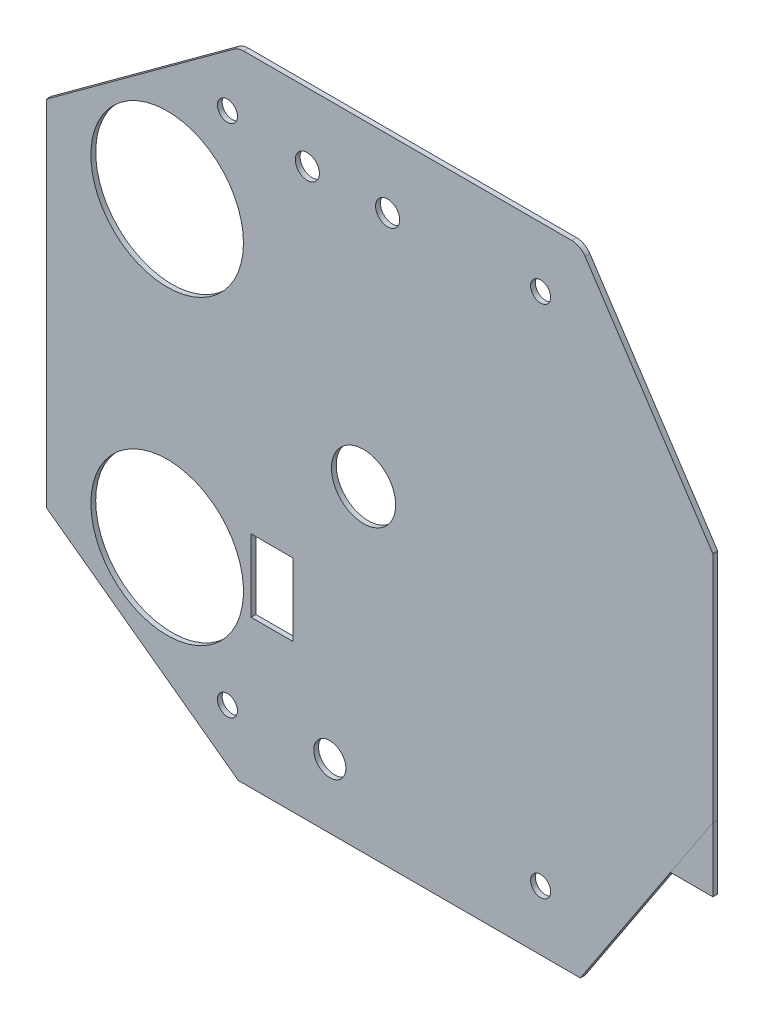
ISO-10303-21;
HEADER;
FILE_DESCRIPTION(('STEP AP214'),'2;1');
FILE_NAME('part.step','',(''),(''),'','','');
FILE_SCHEMA(('AUTOMOTIVE_DESIGN { 1 0 10303 214 1 1 1 1 }'));
ENDSEC;
DATA;
#1=APPLICATION_CONTEXT('core data for automotive mechanical design processes');
#2=APPLICATION_PROTOCOL_DEFINITION('international standard','automotive_design',2000,#1);
#3=PRODUCT_CONTEXT('',#1,'mechanical');
#4=PRODUCT('Part','Part','',(#3));
#5=PRODUCT_RELATED_PRODUCT_CATEGORY('part','',(#4));
#6=PRODUCT_DEFINITION_FORMATION('','',#4);
#7=PRODUCT_DEFINITION_CONTEXT('part definition',#1,'design');
#8=PRODUCT_DEFINITION('design','',#6,#7);
#9=PRODUCT_DEFINITION_SHAPE('','',#8);
#10=(LENGTH_UNIT() NAMED_UNIT(*) SI_UNIT(.MILLI.,.METRE.));
#11=(NAMED_UNIT(*) PLANE_ANGLE_UNIT() SI_UNIT($,.RADIAN.));
#12=(NAMED_UNIT(*) SI_UNIT($,.STERADIAN.) SOLID_ANGLE_UNIT());
#13=UNCERTAINTY_MEASURE_WITH_UNIT(LENGTH_MEASURE(1.E-05),#10,'distance_accuracy_value','');
#14=(GEOMETRIC_REPRESENTATION_CONTEXT(3) GLOBAL_UNCERTAINTY_ASSIGNED_CONTEXT((#13)) GLOBAL_UNIT_ASSIGNED_CONTEXT((#10,
#11,#12)) REPRESENTATION_CONTEXT('',''));
#15=CARTESIAN_POINT('',(0.,0.,0.));
#16=DIRECTION('',(0.,0.,1.));
#17=DIRECTION('',(1.,0.,0.));
#18=AXIS2_PLACEMENT_3D('',#15,#16,#17);
#19=CARTESIAN_POINT('',(77.7200000000001,-22.5,0.));
#20=DIRECTION('',(-0.834609406561726,0.550842208330738,0.));
#21=DIRECTION('',(-0.550842208330738,-0.834609406561726,0.));
#22=AXIS2_PLACEMENT_3D('',#19,#20,#21);
#23=PLANE('',#22);
#24=DIRECTION('',(-0.550842208330738,-0.834609406561726,0.));
#25=VECTOR('',#24,1.);
#26=CARTESIAN_POINT('',(77.7200000000001,-22.5,0.6));
#27=LINE('',#26,#25);
#28=CARTESIAN_POINT('',(83.,-14.5,0.6));
#29=VERTEX_POINT('',#28);
#30=CARTESIAN_POINT('',(77.7200000000001,-22.5,0.6));
#31=VERTEX_POINT('',#30);
#32=EDGE_CURVE('E96',#29,#31,#27,.T.);
#33=ORIENTED_EDGE('',*,*,#32,.F.);
#34=DIRECTION('',(0.,0.,1.));
#35=VECTOR('',#34,1.);
#36=CARTESIAN_POINT('',(83.,-14.5,0.));
#37=LINE('',#36,#35);
#38=CARTESIAN_POINT('',(83.,-14.5,0.));
#39=VERTEX_POINT('',#38);
#40=EDGE_CURVE('E12',#39,#29,#37,.T.);
#41=ORIENTED_EDGE('',*,*,#40,.F.);
#42=DIRECTION('',(-0.550842208330738,-0.834609406561726,0.));
#43=VECTOR('',#42,1.);
#44=CARTESIAN_POINT('',(77.7200000000001,-22.5,0.));
#45=LINE('',#44,#43);
#46=CARTESIAN_POINT('',(77.7200000000001,-22.5,0.));
#47=VERTEX_POINT('',#46);
#48=EDGE_CURVE('E88',#39,#47,#45,.T.);
#49=ORIENTED_EDGE('',*,*,#48,.T.);
#50=DIRECTION('',(0.,0.,1.));
#51=VECTOR('',#50,1.);
#52=CARTESIAN_POINT('',(77.7200000000001,-22.5,0.));
#53=LINE('',#52,#51);
#54=EDGE_CURVE('E47',#47,#31,#53,.T.);
#55=ORIENTED_EDGE('',*,*,#54,.T.);
#56=EDGE_LOOP('',(#33,#41,#49,#55));
#57=FACE_BOUND('',#56,.T.);
#58=ADVANCED_FACE('F44',(#57),#23,.T.);
#59=CARTESIAN_POINT('',(83.,-14.5,0.));
#60=DIRECTION('',(1.,0.,0.));
#61=DIRECTION('',(0.,0.,-1.));
#62=AXIS2_PLACEMENT_3D('',#59,#60,#61);
#63=PLANE('',#62);
#64=DIRECTION('',(0.,1.,0.));
#65=VECTOR('',#64,1.);
#66=CARTESIAN_POINT('',(83.,-14.5,0.6));
#67=LINE('',#66,#65);
#68=CARTESIAN_POINT('',(83.,-22.5,0.6));
#69=VERTEX_POINT('',#68);
#70=EDGE_CURVE('E90',#69,#29,#67,.T.);
#71=ORIENTED_EDGE('',*,*,#70,.F.);
#72=DIRECTION('',(0.,0.,1.));
#73=VECTOR('',#72,1.);
#74=CARTESIAN_POINT('',(83.,-22.5,0.));
#75=LINE('',#74,#73);
#76=CARTESIAN_POINT('',(83.,-22.5,0.));
#77=VERTEX_POINT('',#76);
#78=EDGE_CURVE('E53',#77,#69,#75,.T.);
#79=ORIENTED_EDGE('',*,*,#78,.F.);
#80=DIRECTION('',(0.,1.,0.));
#81=VECTOR('',#80,1.);
#82=CARTESIAN_POINT('',(83.,-14.5,0.));
#83=LINE('',#82,#81);
#84=EDGE_CURVE('E85',#77,#39,#83,.T.);
#85=ORIENTED_EDGE('',*,*,#84,.T.);
#86=ORIENTED_EDGE('',*,*,#40,.T.);
#87=EDGE_LOOP('',(#71,#79,#85,#86));
#88=FACE_BOUND('',#87,.T.);
#89=ADVANCED_FACE('F100',(#88),#63,.T.);
#90=CARTESIAN_POINT('',(83.,-22.5,0.));
#91=DIRECTION('',(0.,-1.,0.));
#92=DIRECTION('',(0.,0.,-1.));
#93=AXIS2_PLACEMENT_3D('',#90,#91,#92);
#94=PLANE('',#93);
#95=DIRECTION('',(1.,0.,0.));
#96=VECTOR('',#95,1.);
#97=CARTESIAN_POINT('',(83.,-22.5,0.6));
#98=LINE('',#97,#96);
#99=EDGE_CURVE('E83',#31,#69,#98,.T.);
#100=ORIENTED_EDGE('',*,*,#99,.F.);
#101=ORIENTED_EDGE('',*,*,#54,.F.);
#102=DIRECTION('',(1.,0.,0.));
#103=VECTOR('',#102,1.);
#104=CARTESIAN_POINT('',(83.,-22.5,0.));
#105=LINE('',#104,#103);
#106=EDGE_CURVE('E81',#47,#77,#105,.T.);
#107=ORIENTED_EDGE('',*,*,#106,.T.);
#108=ORIENTED_EDGE('',*,*,#78,.T.);
#109=EDGE_LOOP('',(#100,#101,#107,#108));
#110=FACE_BOUND('',#109,.T.);
#111=ADVANCED_FACE('F80',(#110),#94,.T.);
#112=CARTESIAN_POINT('',(77.7200000000001,-22.5,0.));
#113=DIRECTION('',(0.,0.,1.));
#114=DIRECTION('',(1.,0.,0.));
#115=AXIS2_PLACEMENT_3D('',#112,#113,#114);
#116=PLANE('',#115);
#117=ORIENTED_EDGE('',*,*,#48,.F.);
#118=ORIENTED_EDGE('',*,*,#84,.F.);
#119=ORIENTED_EDGE('',*,*,#106,.F.);
#120=EDGE_LOOP('',(#117,#118,#119));
#121=FACE_BOUND('',#120,.T.);
#122=ADVANCED_FACE('F87',(#121),#116,.F.);
#123=CARTESIAN_POINT('',(77.7200000000001,-22.5,0.6));
#124=DIRECTION('',(0.,0.,1.));
#125=DIRECTION('',(1.,0.,0.));
#126=AXIS2_PLACEMENT_3D('',#123,#124,#125);
#127=PLANE('',#126);
#128=ORIENTED_EDGE('',*,*,#32,.T.);
#129=ORIENTED_EDGE('',*,*,#99,.T.);
#130=ORIENTED_EDGE('',*,*,#70,.T.);
#131=EDGE_LOOP('',(#128,#129,#130));
#132=FACE_BOUND('',#131,.T.);
#133=ADVANCED_FACE('F99',(#132),#127,.T.);
#134=CLOSED_SHELL('',(#58,#89,#111,#122,#133));
#135=MANIFOLD_SOLID_BREP('B2',#134);
#136=CARTESIAN_POINT('',(65.42366947188,37.5,0.600000000000001));
#137=DIRECTION('',(0.,0.,-1.));
#138=DIRECTION('',(-1.,0.,0.));
#139=AXIS2_PLACEMENT_3D('',#136,#137,#138);
#140=PLANE('',#139);
#141=CARTESIAN_POINT('',(42.5,31.,0.6));
#142=DIRECTION('',(0.,0.,1.));
#143=DIRECTION('',(1.,0.,0.));
#144=AXIS2_PLACEMENT_3D('',#141,#142,#143);
#145=CIRCLE('',#144,1.5);
#146=CARTESIAN_POINT('',(44.,31.,0.6));
#147=VERTEX_POINT('',#146);
#148=EDGE_CURVE('E681',#147,#147,#145,.T.);
#149=ORIENTED_EDGE('',*,*,#148,.F.);
#150=EDGE_LOOP('',(#149));
#151=FACE_BOUND('',#150,.T.);
#152=CARTESIAN_POINT('',(32.5,31.,0.6));
#153=DIRECTION('',(0.,0.,1.));
#154=DIRECTION('',(1.,0.,0.));
#155=AXIS2_PLACEMENT_3D('',#152,#153,#154);
#156=CIRCLE('',#155,1.5);
#157=CARTESIAN_POINT('',(34.,31.,0.6));
#158=VERTEX_POINT('',#157);
#159=EDGE_CURVE('E683',#158,#158,#156,.T.);
#160=ORIENTED_EDGE('',*,*,#159,.F.);
#161=EDGE_LOOP('',(#160));
#162=FACE_BOUND('',#161,.T.);
#163=CARTESIAN_POINT('',(35.3006231471002,-31.5,0.6));
#164=DIRECTION('',(0.,0.,1.));
#165=DIRECTION('',(1.,0.,0.));
#166=AXIS2_PLACEMENT_3D('',#163,#164,#165);
#167=CIRCLE('',#166,2.);
#168=CARTESIAN_POINT('',(37.3006231471002,-31.5,0.6));
#169=VERTEX_POINT('',#168);
#170=EDGE_CURVE('E266',#169,#169,#167,.T.);
#171=ORIENTED_EDGE('',*,*,#170,.F.);
#172=EDGE_LOOP('',(#171));
#173=FACE_BOUND('',#172,.T.);
#174=DIRECTION('',(1.,0.,0.));
#175=VECTOR('',#174,1.);
#176=CARTESIAN_POINT('',(25.5,-21.1,0.6));
#177=LINE('',#176,#175);
#178=CARTESIAN_POINT('',(25.5,-21.1,0.6));
#179=VERTEX_POINT('',#178);
#180=CARTESIAN_POINT('',(30.7,-21.1,0.6));
#181=VERTEX_POINT('',#180);
#182=EDGE_CURVE('E272',#179,#181,#177,.T.);
#183=ORIENTED_EDGE('',*,*,#182,.F.);
#184=DIRECTION('',(0.,-1.,0.));
#185=VECTOR('',#184,1.);
#186=CARTESIAN_POINT('',(25.5,-12.1,0.600000000000001));
#187=LINE('',#186,#185);
#188=CARTESIAN_POINT('',(25.5,-12.1,0.600000000000001));
#189=VERTEX_POINT('',#188);
#190=EDGE_CURVE('E156',#189,#179,#187,.T.);
#191=ORIENTED_EDGE('',*,*,#190,.F.);
#192=DIRECTION('',(-1.,0.,0.));
#193=VECTOR('',#192,1.);
#194=CARTESIAN_POINT('',(25.5,-12.1,0.600000000000001));
#195=LINE('',#194,#193);
#196=CARTESIAN_POINT('',(30.7,-12.1,0.600000000000001));
#197=VERTEX_POINT('',#196);
#198=EDGE_CURVE('E260',#197,#189,#195,.T.);
#199=ORIENTED_EDGE('',*,*,#198,.F.);
#200=DIRECTION('',(0.,1.,0.));
#201=VECTOR('',#200,1.);
#202=CARTESIAN_POINT('',(30.7,-12.1,0.600000000000001));
#203=LINE('',#202,#201);
#204=EDGE_CURVE('E263',#181,#197,#203,.T.);
#205=ORIENTED_EDGE('',*,*,#204,.F.);
#206=EDGE_LOOP('',(#183,#191,#199,#205));
#207=FACE_BOUND('',#206,.T.);
#208=CARTESIAN_POINT('',(22.5506231471002,-32.05,0.6));
#209=DIRECTION('',(0.,0.,1.));
#210=DIRECTION('',(-1.,0.,0.));
#211=AXIS2_PLACEMENT_3D('',#208,#209,#210);
#212=CIRCLE('',#211,1.25);
#213=CARTESIAN_POINT('',(21.3006231471002,-32.05,0.6));
#214=VERTEX_POINT('',#213);
#215=EDGE_CURVE('E289',#214,#214,#212,.T.);
#216=ORIENTED_EDGE('',*,*,#215,.F.);
#217=EDGE_LOOP('',(#216));
#218=FACE_BOUND('',#217,.T.);
#219=CARTESIAN_POINT('',(61.5506231471002,32.05,0.6));
#220=DIRECTION('',(0.,0.,1.));
#221=DIRECTION('',(1.,0.,0.));
#222=AXIS2_PLACEMENT_3D('',#219,#220,#221);
#223=CIRCLE('',#222,1.24999999999999);
#224=CARTESIAN_POINT('',(62.8006231471002,32.05,0.6));
#225=VERTEX_POINT('',#224);
#226=EDGE_CURVE('E301',#225,#225,#223,.T.);
#227=ORIENTED_EDGE('',*,*,#226,.F.);
#228=EDGE_LOOP('',(#227));
#229=FACE_BOUND('',#228,.T.);
#230=CARTESIAN_POINT('',(15.0506231471003,-18.7782851821664,0.6));
#231=DIRECTION('',(0.,0.,1.));
#232=DIRECTION('',(-1.,0.,0.));
#233=AXIS2_PLACEMENT_3D('',#230,#231,#232);
#234=CIRCLE('',#233,9.5);
#235=CARTESIAN_POINT('',(5.55062314710029,-18.7782851821664,0.6));
#236=VERTEX_POINT('',#235);
#237=EDGE_CURVE('E313',#236,#236,#234,.T.);
#238=ORIENTED_EDGE('',*,*,#237,.F.);
#239=EDGE_LOOP('',(#238));
#240=FACE_BOUND('',#239,.T.);
#241=CARTESIAN_POINT('',(65.42366947188,37.5,0.600000000000001));
#242=DIRECTION('',(0.,0.,1.));
#243=DIRECTION('',(-1.,0.,0.));
#244=AXIS2_PLACEMENT_3D('',#241,#242,#243);
#245=CIRCLE('',#244,1.99999999999999);
#246=CARTESIAN_POINT('',(67.0928882850035,38.6016844166615,0.6));
#247=VERTEX_POINT('',#246);
#248=CARTESIAN_POINT('',(65.42366947188,39.5,0.6));
#249=VERTEX_POINT('',#248);
#250=EDGE_CURVE('E325',#247,#249,#245,.T.);
#251=ORIENTED_EDGE('',*,*,#250,.T.);
#252=DIRECTION('',(-1.,0.,0.));
#253=VECTOR('',#252,1.);
#254=CARTESIAN_POINT('',(24.5641161351126,39.5,0.6));
#255=LINE('',#254,#253);
#256=CARTESIAN_POINT('',(24.5641161351126,39.5,0.6));
#257=VERTEX_POINT('',#256);
#258=EDGE_CURVE('E328',#249,#257,#255,.T.);
#259=ORIENTED_EDGE('',*,*,#258,.T.);
#260=CARTESIAN_POINT('',(24.5641161351126,37.5,0.600000000000001));
#261=DIRECTION('',(0.,0.,1.));
#262=DIRECTION('',(-1.,0.,0.));
#263=AXIS2_PLACEMENT_3D('',#260,#261,#262);
#264=CIRCLE('',#263,1.99999999999999);
#265=CARTESIAN_POINT('',(23.3838564030877,39.1146166619234,0.6));
#266=VERTEX_POINT('',#265);
#267=EDGE_CURVE('E331',#257,#266,#264,.T.);
#268=ORIENTED_EDGE('',*,*,#267,.T.);
#269=DIRECTION('',(-0.807308330961687,-0.590129866012436,0.));
#270=VECTOR('',#269,1.);
#271=CARTESIAN_POINT('',(23.3838564030877,39.1146166619234,0.6));
#272=LINE('',#271,#270);
#273=CARTESIAN_POINT('',(0.,22.0213803892717,0.600000000000001));
#274=VERTEX_POINT('',#273);
#275=EDGE_CURVE('E333',#266,#274,#272,.T.);
#276=ORIENTED_EDGE('',*,*,#275,.T.);
#277=DIRECTION('',(0.,-1.,0.));
#278=VECTOR('',#277,1.);
#279=CARTESIAN_POINT('',(0.,-22.0213803892717,0.6));
#280=LINE('',#279,#278);
#281=CARTESIAN_POINT('',(0.,-22.0213803892717,0.6));
#282=VERTEX_POINT('',#281);
#283=EDGE_CURVE('E335',#274,#282,#280,.T.);
#284=ORIENTED_EDGE('',*,*,#283,.T.);
#285=DIRECTION('',(0.807308330961688,-0.590129866012436,0.));
#286=VECTOR('',#285,1.);
#287=CARTESIAN_POINT('',(23.9110677803823,-39.5,0.600000000000001));
#288=LINE('',#287,#286);
#289=CARTESIAN_POINT('',(23.9110677803823,-39.5,0.600000000000001));
#290=VERTEX_POINT('',#289);
#291=EDGE_CURVE('E337',#282,#290,#288,.T.);
#292=ORIENTED_EDGE('',*,*,#291,.T.);
#293=DIRECTION('',(1.,0.,0.));
#294=VECTOR('',#293,1.);
#295=CARTESIAN_POINT('',(23.9110677803823,-39.5,0.600000000000001));
#296=LINE('',#295,#294);
#297=CARTESIAN_POINT('',(66.5,-39.5,0.600000000000001));
#298=VERTEX_POINT('',#297);
#299=EDGE_CURVE('E339',#290,#298,#296,.T.);
#300=ORIENTED_EDGE('',*,*,#299,.T.);
#301=DIRECTION('',(0.550842208330739,0.834609406561725,0.));
#302=VECTOR('',#301,1.);
#303=CARTESIAN_POINT('',(83.,-14.5,0.6));
#304=LINE('',#303,#302);
#305=CARTESIAN_POINT('',(83.,-14.5,0.6));
#306=VERTEX_POINT('',#305);
#307=EDGE_CURVE('E341',#298,#306,#304,.T.);
#308=ORIENTED_EDGE('',*,*,#307,.T.);
#309=DIRECTION('',(0.,1.,0.));
#310=VECTOR('',#309,1.);
#311=CARTESIAN_POINT('',(83.,-14.5,0.6));
#312=LINE('',#311,#310);
#313=CARTESIAN_POINT('',(83.,14.5,0.6));
#314=VERTEX_POINT('',#313);
#315=EDGE_CURVE('E343',#306,#314,#312,.T.);
#316=ORIENTED_EDGE('',*,*,#315,.T.);
#317=DIRECTION('',(-0.550842208330739,0.834609406561726,0.));
#318=VECTOR('',#317,1.);
#319=CARTESIAN_POINT('',(83.,14.5,0.6));
#320=LINE('',#319,#318);
#321=EDGE_CURVE('E345',#314,#247,#320,.T.);
#322=ORIENTED_EDGE('',*,*,#321,.T.);
#323=EDGE_LOOP('',(#251,#259,#268,#276,#284,#292,#300,#308,#316,#322));
#324=FACE_BOUND('',#323,.T.);
#325=CARTESIAN_POINT('',(15.0506231471003,18.7782851821664,0.6));
#326=DIRECTION('',(0.,0.,1.));
#327=DIRECTION('',(1.,0.,0.));
#328=AXIS2_PLACEMENT_3D('',#325,#326,#327);
#329=CIRCLE('',#328,9.50000000000001);
#330=CARTESIAN_POINT('',(24.5506231471003,18.7782851821664,0.6));
#331=VERTEX_POINT('',#330);
#332=EDGE_CURVE('E319',#331,#331,#329,.T.);
#333=ORIENTED_EDGE('',*,*,#332,.F.);
#334=EDGE_LOOP('',(#333));
#335=FACE_BOUND('',#334,.T.);
#336=CARTESIAN_POINT('',(22.5506231471002,32.05,0.6));
#337=DIRECTION('',(0.,0.,1.));
#338=DIRECTION('',(1.,0.,0.));
#339=AXIS2_PLACEMENT_3D('',#336,#337,#338);
#340=CIRCLE('',#339,1.25);
#341=CARTESIAN_POINT('',(23.8006231471002,32.05,0.6));
#342=VERTEX_POINT('',#341);
#343=EDGE_CURVE('E307',#342,#342,#340,.T.);
#344=ORIENTED_EDGE('',*,*,#343,.F.);
#345=EDGE_LOOP('',(#344));
#346=FACE_BOUND('',#345,.T.);
#347=CARTESIAN_POINT('',(61.5506231471002,-32.05,0.6));
#348=DIRECTION('',(0.,0.,1.));
#349=DIRECTION('',(-1.,0.,0.));
#350=AXIS2_PLACEMENT_3D('',#347,#348,#349);
#351=CIRCLE('',#350,1.24999999999999);
#352=CARTESIAN_POINT('',(60.3006231471002,-32.05,0.6));
#353=VERTEX_POINT('',#352);
#354=EDGE_CURVE('E295',#353,#353,#351,.T.);
#355=ORIENTED_EDGE('',*,*,#354,.F.);
#356=EDGE_LOOP('',(#355));
#357=FACE_BOUND('',#356,.T.);
#358=CARTESIAN_POINT('',(39.5,0.,0.6));
#359=DIRECTION('',(0.,0.,1.));
#360=DIRECTION('',(1.,0.,0.));
#361=AXIS2_PLACEMENT_3D('',#358,#359,#360);
#362=CIRCLE('',#361,4.);
#363=CARTESIAN_POINT('',(43.5,0.,0.6));
#364=VERTEX_POINT('',#363);
#365=EDGE_CURVE('E283',#364,#364,#362,.T.);
#366=ORIENTED_EDGE('',*,*,#365,.F.);
#367=EDGE_LOOP('',(#366));
#368=FACE_BOUND('',#367,.T.);
#369=ADVANCED_FACE('F141',(#151,#162,#173,#207,#218,#229,#240,#324,#335,#346,#357,#368),#140,.F.);
#370=CARTESIAN_POINT('',(65.42366947188,37.5,0.));
#371=DIRECTION('',(0.,0.,-1.));
#372=DIRECTION('',(-1.,0.,0.));
#373=AXIS2_PLACEMENT_3D('',#370,#371,#372);
#374=PLANE('',#373);
#375=CARTESIAN_POINT('',(42.5,31.,0.));
#376=DIRECTION('',(0.,0.,1.));
#377=DIRECTION('',(1.,0.,0.));
#378=AXIS2_PLACEMENT_3D('',#375,#376,#377);
#379=CIRCLE('',#378,1.5);
#380=CARTESIAN_POINT('',(44.,31.,0.));
#381=VERTEX_POINT('',#380);
#382=EDGE_CURVE('E679',#381,#381,#379,.T.);
#383=ORIENTED_EDGE('',*,*,#382,.T.);
#384=EDGE_LOOP('',(#383));
#385=FACE_BOUND('',#384,.T.);
#386=CARTESIAN_POINT('',(32.5,31.,0.));
#387=DIRECTION('',(0.,0.,1.));
#388=DIRECTION('',(1.,0.,0.));
#389=AXIS2_PLACEMENT_3D('',#386,#387,#388);
#390=CIRCLE('',#389,1.5);
#391=CARTESIAN_POINT('',(34.,31.,0.));
#392=VERTEX_POINT('',#391);
#393=EDGE_CURVE('E686',#392,#392,#390,.T.);
#394=ORIENTED_EDGE('',*,*,#393,.T.);
#395=EDGE_LOOP('',(#394));
#396=FACE_BOUND('',#395,.T.);
#397=CARTESIAN_POINT('',(35.3006231471002,-31.5,0.));
#398=DIRECTION('',(0.,0.,1.));
#399=DIRECTION('',(1.,0.,0.));
#400=AXIS2_PLACEMENT_3D('',#397,#398,#399);
#401=CIRCLE('',#400,2.);
#402=CARTESIAN_POINT('',(37.3006231471002,-31.5,0.));
#403=VERTEX_POINT('',#402);
#404=EDGE_CURVE('E273',#403,#403,#401,.T.);
#405=ORIENTED_EDGE('',*,*,#404,.T.);
#406=EDGE_LOOP('',(#405));
#407=FACE_BOUND('',#406,.T.);
#408=DIRECTION('',(0.,-1.,0.));
#409=VECTOR('',#408,1.);
#410=CARTESIAN_POINT('',(25.5,-12.1,0.));
#411=LINE('',#410,#409);
#412=CARTESIAN_POINT('',(25.5,-12.1,0.));
#413=VERTEX_POINT('',#412);
#414=CARTESIAN_POINT('',(25.5,-21.1,0.));
#415=VERTEX_POINT('',#414);
#416=EDGE_CURVE('E244',#413,#415,#411,.T.);
#417=ORIENTED_EDGE('',*,*,#416,.T.);
#418=DIRECTION('',(1.,0.,0.));
#419=VECTOR('',#418,1.);
#420=CARTESIAN_POINT('',(25.5,-21.1,0.));
#421=LINE('',#420,#419);
#422=CARTESIAN_POINT('',(30.7,-21.1,0.));
#423=VERTEX_POINT('',#422);
#424=EDGE_CURVE('E253',#415,#423,#421,.T.);
#425=ORIENTED_EDGE('',*,*,#424,.T.);
#426=DIRECTION('',(0.,1.,0.));
#427=VECTOR('',#426,1.);
#428=CARTESIAN_POINT('',(30.7,-12.1,0.));
#429=LINE('',#428,#427);
#430=CARTESIAN_POINT('',(30.7,-12.1,0.));
#431=VERTEX_POINT('',#430);
#432=EDGE_CURVE('E164',#423,#431,#429,.T.);
#433=ORIENTED_EDGE('',*,*,#432,.T.);
#434=DIRECTION('',(-1.,0.,0.));
#435=VECTOR('',#434,1.);
#436=CARTESIAN_POINT('',(25.5,-12.1,0.));
#437=LINE('',#436,#435);
#438=EDGE_CURVE('E250',#431,#413,#437,.T.);
#439=ORIENTED_EDGE('',*,*,#438,.T.);
#440=EDGE_LOOP('',(#417,#425,#433,#439));
#441=FACE_BOUND('',#440,.T.);
#442=CARTESIAN_POINT('',(22.5506231471002,-32.05,0.));
#443=DIRECTION('',(0.,0.,1.));
#444=DIRECTION('',(-1.,0.,0.));
#445=AXIS2_PLACEMENT_3D('',#442,#443,#444);
#446=CIRCLE('',#445,1.25);
#447=CARTESIAN_POINT('',(21.3006231471002,-32.05,0.));
#448=VERTEX_POINT('',#447);
#449=EDGE_CURVE('E286',#448,#448,#446,.T.);
#450=ORIENTED_EDGE('',*,*,#449,.T.);
#451=EDGE_LOOP('',(#450));
#452=FACE_BOUND('',#451,.T.);
#453=CARTESIAN_POINT('',(61.5506231471002,32.05,0.));
#454=DIRECTION('',(0.,0.,1.));
#455=DIRECTION('',(1.,0.,0.));
#456=AXIS2_PLACEMENT_3D('',#453,#454,#455);
#457=CIRCLE('',#456,1.24999999999999);
#458=CARTESIAN_POINT('',(62.8006231471002,32.05,0.));
#459=VERTEX_POINT('',#458);
#460=EDGE_CURVE('E298',#459,#459,#457,.T.);
#461=ORIENTED_EDGE('',*,*,#460,.T.);
#462=EDGE_LOOP('',(#461));
#463=FACE_BOUND('',#462,.T.);
#464=CARTESIAN_POINT('',(15.0506231471003,-18.7782851821664,0.));
#465=DIRECTION('',(0.,0.,1.));
#466=DIRECTION('',(-1.,0.,0.));
#467=AXIS2_PLACEMENT_3D('',#464,#465,#466);
#468=CIRCLE('',#467,9.5);
#469=CARTESIAN_POINT('',(5.55062314710029,-18.7782851821664,0.));
#470=VERTEX_POINT('',#469);
#471=EDGE_CURVE('E310',#470,#470,#468,.T.);
#472=ORIENTED_EDGE('',*,*,#471,.T.);
#473=EDGE_LOOP('',(#472));
#474=FACE_BOUND('',#473,.T.);
#475=CARTESIAN_POINT('',(65.42366947188,37.5,0.));
#476=DIRECTION('',(0.,0.,1.));
#477=DIRECTION('',(-1.,0.,0.));
#478=AXIS2_PLACEMENT_3D('',#475,#476,#477);
#479=CIRCLE('',#478,1.99999999999999);
#480=CARTESIAN_POINT('',(67.0928882850035,38.6016844166615,0.));
#481=VERTEX_POINT('',#480);
#482=CARTESIAN_POINT('',(65.42366947188,39.5,0.));
#483=VERTEX_POINT('',#482);
#484=EDGE_CURVE('E322',#481,#483,#479,.T.);
#485=ORIENTED_EDGE('',*,*,#484,.F.);
#486=DIRECTION('',(-0.550842208330739,0.834609406561726,0.));
#487=VECTOR('',#486,1.);
#488=CARTESIAN_POINT('',(83.,14.5,0.));
#489=LINE('',#488,#487);
#490=CARTESIAN_POINT('',(83.,14.5,0.));
#491=VERTEX_POINT('',#490);
#492=EDGE_CURVE('E329',#491,#481,#489,.T.);
#493=ORIENTED_EDGE('',*,*,#492,.F.);
#494=DIRECTION('',(0.,1.,0.));
#495=VECTOR('',#494,1.);
#496=CARTESIAN_POINT('',(83.,-14.5,0.));
#497=LINE('',#496,#495);
#498=CARTESIAN_POINT('',(83.,-14.5,0.));
#499=VERTEX_POINT('',#498);
#500=EDGE_CURVE('E364',#499,#491,#497,.T.);
#501=ORIENTED_EDGE('',*,*,#500,.F.);
#502=DIRECTION('',(0.550842208330739,0.834609406561725,0.));
#503=VECTOR('',#502,1.);
#504=CARTESIAN_POINT('',(83.,-14.5,0.));
#505=LINE('',#504,#503);
#506=CARTESIAN_POINT('',(66.5,-39.5,0.));
#507=VERTEX_POINT('',#506);
#508=EDGE_CURVE('E362',#507,#499,#505,.T.);
#509=ORIENTED_EDGE('',*,*,#508,.F.);
#510=DIRECTION('',(1.,0.,0.));
#511=VECTOR('',#510,1.);
#512=CARTESIAN_POINT('',(23.9110677803823,-39.5,0.));
#513=LINE('',#512,#511);
#514=CARTESIAN_POINT('',(23.9110677803823,-39.5,0.));
#515=VERTEX_POINT('',#514);
#516=EDGE_CURVE('E360',#515,#507,#513,.T.);
#517=ORIENTED_EDGE('',*,*,#516,.F.);
#518=DIRECTION('',(0.807308330961688,-0.590129866012436,0.));
#519=VECTOR('',#518,1.);
#520=CARTESIAN_POINT('',(23.9110677803823,-39.5,0.));
#521=LINE('',#520,#519);
#522=CARTESIAN_POINT('',(0.,-22.0213803892717,0.));
#523=VERTEX_POINT('',#522);
#524=EDGE_CURVE('E358',#523,#515,#521,.T.);
#525=ORIENTED_EDGE('',*,*,#524,.F.);
#526=DIRECTION('',(0.,-1.,0.));
#527=VECTOR('',#526,1.);
#528=CARTESIAN_POINT('',(0.,-22.0213803892717,0.));
#529=LINE('',#528,#527);
#530=CARTESIAN_POINT('',(0.,22.0213803892717,0.));
#531=VERTEX_POINT('',#530);
#532=EDGE_CURVE('E356',#531,#523,#529,.T.);
#533=ORIENTED_EDGE('',*,*,#532,.F.);
#534=DIRECTION('',(-0.807308330961687,-0.590129866012436,0.));
#535=VECTOR('',#534,1.);
#536=CARTESIAN_POINT('',(23.3838564030877,39.1146166619234,0.));
#537=LINE('',#536,#535);
#538=CARTESIAN_POINT('',(23.3838564030877,39.1146166619234,0.));
#539=VERTEX_POINT('',#538);
#540=EDGE_CURVE('E354',#539,#531,#537,.T.);
#541=ORIENTED_EDGE('',*,*,#540,.F.);
#542=CARTESIAN_POINT('',(24.5641161351126,37.5,0.));
#543=DIRECTION('',(0.,0.,1.));
#544=DIRECTION('',(-1.,0.,0.));
#545=AXIS2_PLACEMENT_3D('',#542,#543,#544);
#546=CIRCLE('',#545,1.99999999999999);
#547=CARTESIAN_POINT('',(24.5641161351126,39.5,0.));
#548=VERTEX_POINT('',#547);
#549=EDGE_CURVE('E352',#548,#539,#546,.T.);
#550=ORIENTED_EDGE('',*,*,#549,.F.);
#551=DIRECTION('',(-1.,0.,0.));
#552=VECTOR('',#551,1.);
#553=CARTESIAN_POINT('',(24.5641161351126,39.5,0.));
#554=LINE('',#553,#552);
#555=EDGE_CURVE('E350',#483,#548,#554,.T.);
#556=ORIENTED_EDGE('',*,*,#555,.F.);
#557=EDGE_LOOP('',(#485,#493,#501,#509,#517,#525,#533,#541,#550,#556));
#558=FACE_BOUND('',#557,.T.);
#559=CARTESIAN_POINT('',(15.0506231471003,18.7782851821664,0.));
#560=DIRECTION('',(0.,0.,1.));
#561=DIRECTION('',(1.,0.,0.));
#562=AXIS2_PLACEMENT_3D('',#559,#560,#561);
#563=CIRCLE('',#562,9.50000000000001);
#564=CARTESIAN_POINT('',(24.5506231471003,18.7782851821664,0.));
#565=VERTEX_POINT('',#564);
#566=EDGE_CURVE('E316',#565,#565,#563,.T.);
#567=ORIENTED_EDGE('',*,*,#566,.T.);
#568=EDGE_LOOP('',(#567));
#569=FACE_BOUND('',#568,.T.);
#570=CARTESIAN_POINT('',(22.5506231471002,32.05,0.));
#571=DIRECTION('',(0.,0.,1.));
#572=DIRECTION('',(1.,0.,0.));
#573=AXIS2_PLACEMENT_3D('',#570,#571,#572);
#574=CIRCLE('',#573,1.25);
#575=CARTESIAN_POINT('',(23.8006231471002,32.05,0.));
#576=VERTEX_POINT('',#575);
#577=EDGE_CURVE('E304',#576,#576,#574,.T.);
#578=ORIENTED_EDGE('',*,*,#577,.T.);
#579=EDGE_LOOP('',(#578));
#580=FACE_BOUND('',#579,.T.);
#581=CARTESIAN_POINT('',(61.5506231471002,-32.05,0.));
#582=DIRECTION('',(0.,0.,1.));
#583=DIRECTION('',(-1.,0.,0.));
#584=AXIS2_PLACEMENT_3D('',#581,#582,#583);
#585=CIRCLE('',#584,1.24999999999999);
#586=CARTESIAN_POINT('',(60.3006231471002,-32.05,0.));
#587=VERTEX_POINT('',#586);
#588=EDGE_CURVE('E292',#587,#587,#585,.T.);
#589=ORIENTED_EDGE('',*,*,#588,.T.);
#590=EDGE_LOOP('',(#589));
#591=FACE_BOUND('',#590,.T.);
#592=CARTESIAN_POINT('',(39.5,0.,0.));
#593=DIRECTION('',(0.,0.,1.));
#594=DIRECTION('',(1.,0.,0.));
#595=AXIS2_PLACEMENT_3D('',#592,#593,#594);
#596=CIRCLE('',#595,4.);
#597=CARTESIAN_POINT('',(43.5,0.,0.));
#598=VERTEX_POINT('',#597);
#599=EDGE_CURVE('E279',#598,#598,#596,.T.);
#600=ORIENTED_EDGE('',*,*,#599,.T.);
#601=EDGE_LOOP('',(#600));
#602=FACE_BOUND('',#601,.T.);
#603=ADVANCED_FACE('F257',(#385,#396,#407,#441,#452,#463,#474,#558,#569,#580,#591,#602),#374,.T.);
#604=CARTESIAN_POINT('',(65.42366947188,37.5,0.600000000000001));
#605=DIRECTION('',(0.,0.,-1.));
#606=DIRECTION('',(-1.,0.,0.));
#607=AXIS2_PLACEMENT_3D('',#604,#605,#606);
#608=CYLINDRICAL_SURFACE('',#607,1.99999999999999);
#609=ORIENTED_EDGE('',*,*,#484,.T.);
#610=DIRECTION('',(0.,0.,-1.));
#611=VECTOR('',#610,1.);
#612=CARTESIAN_POINT('',(65.42366947188,39.5,0.6));
#613=LINE('',#612,#611);
#614=EDGE_CURVE('E42',#249,#483,#613,.T.);
#615=ORIENTED_EDGE('',*,*,#614,.F.);
#616=ORIENTED_EDGE('',*,*,#250,.F.);
#617=DIRECTION('',(0.,0.,-1.));
#618=VECTOR('',#617,1.);
#619=CARTESIAN_POINT('',(67.0928882850035,38.6016844166615,0.6));
#620=LINE('',#619,#618);
#621=EDGE_CURVE('E347',#247,#481,#620,.T.);
#622=ORIENTED_EDGE('',*,*,#621,.T.);
#623=EDGE_LOOP('',(#609,#615,#616,#622));
#624=FACE_BOUND('',#623,.T.);
#625=ADVANCED_FACE('F143',(#624),#608,.T.);
#626=CARTESIAN_POINT('',(24.5641161351126,39.5,0.6));
#627=DIRECTION('',(0.,-1.,0.));
#628=DIRECTION('',(1.,0.,0.));
#629=AXIS2_PLACEMENT_3D('',#626,#627,#628);
#630=PLANE('',#629);
#631=ORIENTED_EDGE('',*,*,#555,.T.);
#632=DIRECTION('',(0.,0.,-1.));
#633=VECTOR('',#632,1.);
#634=CARTESIAN_POINT('',(24.5641161351126,39.5,0.6));
#635=LINE('',#634,#633);
#636=EDGE_CURVE('E149',#257,#548,#635,.T.);
#637=ORIENTED_EDGE('',*,*,#636,.F.);
#638=ORIENTED_EDGE('',*,*,#258,.F.);
#639=ORIENTED_EDGE('',*,*,#614,.T.);
#640=EDGE_LOOP('',(#631,#637,#638,#639));
#641=FACE_BOUND('',#640,.T.);
#642=ADVANCED_FACE('F417',(#641),#630,.F.);
#643=CARTESIAN_POINT('',(24.5641161351126,37.5,0.600000000000001));
#644=DIRECTION('',(0.,0.,-1.));
#645=DIRECTION('',(-1.,0.,0.));
#646=AXIS2_PLACEMENT_3D('',#643,#644,#645);
#647=CYLINDRICAL_SURFACE('',#646,1.99999999999999);
#648=ORIENTED_EDGE('',*,*,#549,.T.);
#649=DIRECTION('',(0.,0.,-1.));
#650=VECTOR('',#649,1.);
#651=CARTESIAN_POINT('',(23.3838564030877,39.1146166619234,0.6));
#652=LINE('',#651,#650);
#653=EDGE_CURVE('E387',#266,#539,#652,.T.);
#654=ORIENTED_EDGE('',*,*,#653,.F.);
#655=ORIENTED_EDGE('',*,*,#267,.F.);
#656=ORIENTED_EDGE('',*,*,#636,.T.);
#657=EDGE_LOOP('',(#648,#654,#655,#656));
#658=FACE_BOUND('',#657,.T.);
#659=ADVANCED_FACE('F394',(#658),#647,.T.);
#660=CARTESIAN_POINT('',(23.3838564030877,39.1146166619234,0.6));
#661=DIRECTION('',(0.590129866012436,-0.807308330961687,0.));
#662=DIRECTION('',(0.807308330961688,0.590129866012436,0.));
#663=AXIS2_PLACEMENT_3D('',#660,#661,#662);
#664=PLANE('',#663);
#665=ORIENTED_EDGE('',*,*,#540,.T.);
#666=DIRECTION('',(0.,0.,-1.));
#667=VECTOR('',#666,1.);
#668=CARTESIAN_POINT('',(0.,22.0213803892717,0.600000000000001));
#669=LINE('',#668,#667);
#670=EDGE_CURVE('E384',#274,#531,#669,.T.);
#671=ORIENTED_EDGE('',*,*,#670,.F.);
#672=ORIENTED_EDGE('',*,*,#275,.F.);
#673=ORIENTED_EDGE('',*,*,#653,.T.);
#674=EDGE_LOOP('',(#665,#671,#672,#673));
#675=FACE_BOUND('',#674,.T.);
#676=ADVANCED_FACE('F405',(#675),#664,.F.);
#677=CARTESIAN_POINT('',(0.,-22.0213803892717,0.6));
#678=DIRECTION('',(1.,0.,0.));
#679=DIRECTION('',(0.,0.,-1.));
#680=AXIS2_PLACEMENT_3D('',#677,#678,#679);
#681=PLANE('',#680);
#682=ORIENTED_EDGE('',*,*,#532,.T.);
#683=DIRECTION('',(0.,0.,-1.));
#684=VECTOR('',#683,1.);
#685=CARTESIAN_POINT('',(0.,-22.0213803892717,0.6));
#686=LINE('',#685,#684);
#687=EDGE_CURVE('E381',#282,#523,#686,.T.);
#688=ORIENTED_EDGE('',*,*,#687,.F.);
#689=ORIENTED_EDGE('',*,*,#283,.F.);
#690=ORIENTED_EDGE('',*,*,#670,.T.);
#691=EDGE_LOOP('',(#682,#688,#689,#690));
#692=FACE_BOUND('',#691,.T.);
#693=ADVANCED_FACE('F409',(#692),#681,.F.);
#694=CARTESIAN_POINT('',(23.9110677803823,-39.5,0.600000000000001));
#695=DIRECTION('',(0.590129866012436,0.807308330961688,0.));
#696=DIRECTION('',(-0.807308330961688,0.590129866012436,0.));
#697=AXIS2_PLACEMENT_3D('',#694,#695,#696);
#698=PLANE('',#697);
#699=ORIENTED_EDGE('',*,*,#524,.T.);
#700=DIRECTION('',(0.,0.,-1.));
#701=VECTOR('',#700,1.);
#702=CARTESIAN_POINT('',(23.9110677803823,-39.5,0.600000000000001));
#703=LINE('',#702,#701);
#704=EDGE_CURVE('E378',#290,#515,#703,.T.);
#705=ORIENTED_EDGE('',*,*,#704,.F.);
#706=ORIENTED_EDGE('',*,*,#291,.F.);
#707=ORIENTED_EDGE('',*,*,#687,.T.);
#708=EDGE_LOOP('',(#699,#705,#706,#707));
#709=FACE_BOUND('',#708,.T.);
#710=ADVANCED_FACE('F440',(#709),#698,.F.);
#711=CARTESIAN_POINT('',(23.9110677803823,-39.5,0.600000000000001));
#712=DIRECTION('',(0.,1.,0.));
#713=DIRECTION('',(-1.,0.,0.));
#714=AXIS2_PLACEMENT_3D('',#711,#712,#713);
#715=PLANE('',#714);
#716=ORIENTED_EDGE('',*,*,#516,.T.);
#717=DIRECTION('',(0.,0.,-1.));
#718=VECTOR('',#717,1.);
#719=CARTESIAN_POINT('',(66.5,-39.5,0.600000000000001));
#720=LINE('',#719,#718);
#721=EDGE_CURVE('E375',#298,#507,#720,.T.);
#722=ORIENTED_EDGE('',*,*,#721,.F.);
#723=ORIENTED_EDGE('',*,*,#299,.F.);
#724=ORIENTED_EDGE('',*,*,#704,.T.);
#725=EDGE_LOOP('',(#716,#722,#723,#724));
#726=FACE_BOUND('',#725,.T.);
#727=ADVANCED_FACE('F437',(#726),#715,.F.);
#728=CARTESIAN_POINT('',(83.,-14.5,0.6));
#729=DIRECTION('',(-0.834609406561725,0.550842208330739,0.));
#730=DIRECTION('',(-0.550842208330739,-0.834609406561726,0.));
#731=AXIS2_PLACEMENT_3D('',#728,#729,#730);
#732=PLANE('',#731);
#733=ORIENTED_EDGE('',*,*,#508,.T.);
#734=DIRECTION('',(0.,0.,-1.));
#735=VECTOR('',#734,1.);
#736=CARTESIAN_POINT('',(83.,-14.5,0.6));
#737=LINE('',#736,#735);
#738=EDGE_CURVE('E372',#306,#499,#737,.T.);
#739=ORIENTED_EDGE('',*,*,#738,.F.);
#740=ORIENTED_EDGE('',*,*,#307,.F.);
#741=ORIENTED_EDGE('',*,*,#721,.T.);
#742=EDGE_LOOP('',(#733,#739,#740,#741));
#743=FACE_BOUND('',#742,.T.);
#744=ADVANCED_FACE('F433',(#743),#732,.F.);
#745=CARTESIAN_POINT('',(83.,-14.5,0.6));
#746=DIRECTION('',(-1.,0.,0.));
#747=DIRECTION('',(0.,0.,1.));
#748=AXIS2_PLACEMENT_3D('',#745,#746,#747);
#749=PLANE('',#748);
#750=ORIENTED_EDGE('',*,*,#500,.T.);
#751=DIRECTION('',(0.,0.,-1.));
#752=VECTOR('',#751,1.);
#753=CARTESIAN_POINT('',(83.,14.5,0.6));
#754=LINE('',#753,#752);
#755=EDGE_CURVE('E369',#314,#491,#754,.T.);
#756=ORIENTED_EDGE('',*,*,#755,.F.);
#757=ORIENTED_EDGE('',*,*,#315,.F.);
#758=ORIENTED_EDGE('',*,*,#738,.T.);
#759=EDGE_LOOP('',(#750,#756,#757,#758));
#760=FACE_BOUND('',#759,.T.);
#761=ADVANCED_FACE('F429',(#760),#749,.F.);
#762=CARTESIAN_POINT('',(83.,14.5,0.6));
#763=DIRECTION('',(-0.834609406561725,-0.550842208330739,0.));
#764=DIRECTION('',(0.550842208330739,-0.834609406561726,0.));
#765=AXIS2_PLACEMENT_3D('',#762,#763,#764);
#766=PLANE('',#765);
#767=ORIENTED_EDGE('',*,*,#492,.T.);
#768=ORIENTED_EDGE('',*,*,#621,.F.);
#769=ORIENTED_EDGE('',*,*,#321,.F.);
#770=ORIENTED_EDGE('',*,*,#755,.T.);
#771=EDGE_LOOP('',(#767,#768,#769,#770));
#772=FACE_BOUND('',#771,.T.);
#773=ADVANCED_FACE('F424',(#772),#766,.F.);
#774=CARTESIAN_POINT('',(15.0506231471003,18.7782851821664,0.6));
#775=DIRECTION('',(0.,0.,-1.));
#776=DIRECTION('',(-1.,0.,0.));
#777=AXIS2_PLACEMENT_3D('',#774,#775,#776);
#778=CYLINDRICAL_SURFACE('',#777,9.50000000000001);
#779=ORIENTED_EDGE('',*,*,#332,.T.);
#780=EDGE_LOOP('',(#779));
#781=FACE_BOUND('',#780,.T.);
#782=ORIENTED_EDGE('',*,*,#566,.F.);
#783=EDGE_LOOP('',(#782));
#784=FACE_BOUND('',#783,.T.);
#785=ADVANCED_FACE('F460',(#781,#784),#778,.F.);
#786=CARTESIAN_POINT('',(15.0506231471003,-18.7782851821664,0.6));
#787=DIRECTION('',(0.,0.,-1.));
#788=DIRECTION('',(-1.,0.,0.));
#789=AXIS2_PLACEMENT_3D('',#786,#787,#788);
#790=CYLINDRICAL_SURFACE('',#789,9.5);
#791=ORIENTED_EDGE('',*,*,#237,.T.);
#792=EDGE_LOOP('',(#791));
#793=FACE_BOUND('',#792,.T.);
#794=ORIENTED_EDGE('',*,*,#471,.F.);
#795=EDGE_LOOP('',(#794));
#796=FACE_BOUND('',#795,.T.);
#797=ADVANCED_FACE('F486',(#793,#796),#790,.F.);
#798=CARTESIAN_POINT('',(22.5506231471002,32.05,0.6));
#799=DIRECTION('',(0.,0.,-1.));
#800=DIRECTION('',(-1.,0.,0.));
#801=AXIS2_PLACEMENT_3D('',#798,#799,#800);
#802=CYLINDRICAL_SURFACE('',#801,1.25);
#803=ORIENTED_EDGE('',*,*,#343,.T.);
#804=EDGE_LOOP('',(#803));
#805=FACE_BOUND('',#804,.T.);
#806=ORIENTED_EDGE('',*,*,#577,.F.);
#807=EDGE_LOOP('',(#806));
#808=FACE_BOUND('',#807,.T.);
#809=ADVANCED_FACE('F493',(#805,#808),#802,.F.);
#810=CARTESIAN_POINT('',(61.5506231471002,32.05,0.6));
#811=DIRECTION('',(0.,0.,-1.));
#812=DIRECTION('',(-1.,0.,0.));
#813=AXIS2_PLACEMENT_3D('',#810,#811,#812);
#814=CYLINDRICAL_SURFACE('',#813,1.24999999999999);
#815=ORIENTED_EDGE('',*,*,#226,.T.);
#816=EDGE_LOOP('',(#815));
#817=FACE_BOUND('',#816,.T.);
#818=ORIENTED_EDGE('',*,*,#460,.F.);
#819=EDGE_LOOP('',(#818));
#820=FACE_BOUND('',#819,.T.);
#821=ADVANCED_FACE('F500',(#817,#820),#814,.F.);
#822=CARTESIAN_POINT('',(61.5506231471002,-32.05,0.6));
#823=DIRECTION('',(0.,0.,-1.));
#824=DIRECTION('',(-1.,0.,0.));
#825=AXIS2_PLACEMENT_3D('',#822,#823,#824);
#826=CYLINDRICAL_SURFACE('',#825,1.24999999999999);
#827=ORIENTED_EDGE('',*,*,#354,.T.);
#828=EDGE_LOOP('',(#827));
#829=FACE_BOUND('',#828,.T.);
#830=ORIENTED_EDGE('',*,*,#588,.F.);
#831=EDGE_LOOP('',(#830));
#832=FACE_BOUND('',#831,.T.);
#833=ADVANCED_FACE('F508',(#829,#832),#826,.F.);
#834=CARTESIAN_POINT('',(22.5506231471002,-32.05,0.6));
#835=DIRECTION('',(0.,0.,-1.));
#836=DIRECTION('',(-1.,0.,0.));
#837=AXIS2_PLACEMENT_3D('',#834,#835,#836);
#838=CYLINDRICAL_SURFACE('',#837,1.25);
#839=ORIENTED_EDGE('',*,*,#215,.T.);
#840=EDGE_LOOP('',(#839));
#841=FACE_BOUND('',#840,.T.);
#842=ORIENTED_EDGE('',*,*,#449,.F.);
#843=EDGE_LOOP('',(#842));
#844=FACE_BOUND('',#843,.T.);
#845=ADVANCED_FACE('F516',(#841,#844),#838,.F.);
#846=CARTESIAN_POINT('',(39.5,0.,0.6));
#847=DIRECTION('',(0.,0.,-1.));
#848=DIRECTION('',(-1.,0.,0.));
#849=AXIS2_PLACEMENT_3D('',#846,#847,#848);
#850=CYLINDRICAL_SURFACE('',#849,4.);
#851=ORIENTED_EDGE('',*,*,#365,.T.);
#852=EDGE_LOOP('',(#851));
#853=FACE_BOUND('',#852,.T.);
#854=ORIENTED_EDGE('',*,*,#599,.F.);
#855=EDGE_LOOP('',(#854));
#856=FACE_BOUND('',#855,.T.);
#857=ADVANCED_FACE('F524',(#853,#856),#850,.F.);
#858=CARTESIAN_POINT('',(25.5,-12.1,0.));
#859=DIRECTION('',(-1.,0.,0.));
#860=DIRECTION('',(0.,0.,1.));
#861=AXIS2_PLACEMENT_3D('',#858,#859,#860);
#862=PLANE('',#861);
#863=ORIENTED_EDGE('',*,*,#190,.T.);
#864=DIRECTION('',(0.,0.,1.));
#865=VECTOR('',#864,1.);
#866=CARTESIAN_POINT('',(25.5,-21.1,0.));
#867=LINE('',#866,#865);
#868=EDGE_CURVE('E240',#415,#179,#867,.T.);
#869=ORIENTED_EDGE('',*,*,#868,.F.);
#870=ORIENTED_EDGE('',*,*,#416,.F.);
#871=DIRECTION('',(0.,0.,1.));
#872=VECTOR('',#871,1.);
#873=CARTESIAN_POINT('',(25.5,-12.1,0.));
#874=LINE('',#873,#872);
#875=EDGE_CURVE('E277',#413,#189,#874,.T.);
#876=ORIENTED_EDGE('',*,*,#875,.T.);
#877=EDGE_LOOP('',(#863,#869,#870,#876));
#878=FACE_BOUND('',#877,.T.);
#879=ADVANCED_FACE('F242',(#878),#862,.F.);
#880=CARTESIAN_POINT('',(25.5,-12.1,0.));
#881=DIRECTION('',(0.,1.,0.));
#882=DIRECTION('',(0.,0.,1.));
#883=AXIS2_PLACEMENT_3D('',#880,#881,#882);
#884=PLANE('',#883);
#885=ORIENTED_EDGE('',*,*,#198,.T.);
#886=ORIENTED_EDGE('',*,*,#875,.F.);
#887=ORIENTED_EDGE('',*,*,#438,.F.);
#888=DIRECTION('',(0.,0.,1.));
#889=VECTOR('',#888,1.);
#890=CARTESIAN_POINT('',(30.7,-12.1,0.));
#891=LINE('',#890,#889);
#892=EDGE_CURVE('E280',#431,#197,#891,.T.);
#893=ORIENTED_EDGE('',*,*,#892,.T.);
#894=EDGE_LOOP('',(#885,#886,#887,#893));
#895=FACE_BOUND('',#894,.T.);
#896=ADVANCED_FACE('F539',(#895),#884,.F.);
#897=CARTESIAN_POINT('',(30.7,-12.1,0.));
#898=DIRECTION('',(1.,0.,0.));
#899=DIRECTION('',(0.,0.,-1.));
#900=AXIS2_PLACEMENT_3D('',#897,#898,#899);
#901=PLANE('',#900);
#902=ORIENTED_EDGE('',*,*,#204,.T.);
#903=ORIENTED_EDGE('',*,*,#892,.F.);
#904=ORIENTED_EDGE('',*,*,#432,.F.);
#905=DIRECTION('',(0.,0.,1.));
#906=VECTOR('',#905,1.);
#907=CARTESIAN_POINT('',(30.7,-21.1,0.));
#908=LINE('',#907,#906);
#909=EDGE_CURVE('E249',#423,#181,#908,.T.);
#910=ORIENTED_EDGE('',*,*,#909,.T.);
#911=EDGE_LOOP('',(#902,#903,#904,#910));
#912=FACE_BOUND('',#911,.T.);
#913=ADVANCED_FACE('F546',(#912),#901,.F.);
#914=CARTESIAN_POINT('',(25.5,-21.1,0.));
#915=DIRECTION('',(0.,-1.,0.));
#916=DIRECTION('',(0.,0.,-1.));
#917=AXIS2_PLACEMENT_3D('',#914,#915,#916);
#918=PLANE('',#917);
#919=ORIENTED_EDGE('',*,*,#182,.T.);
#920=ORIENTED_EDGE('',*,*,#909,.F.);
#921=ORIENTED_EDGE('',*,*,#424,.F.);
#922=ORIENTED_EDGE('',*,*,#868,.T.);
#923=EDGE_LOOP('',(#919,#920,#921,#922));
#924=FACE_BOUND('',#923,.T.);
#925=ADVANCED_FACE('F254',(#924),#918,.F.);
#926=CARTESIAN_POINT('',(35.3006231471002,-31.5,0.));
#927=DIRECTION('',(0.,0.,1.));
#928=DIRECTION('',(1.,0.,0.));
#929=AXIS2_PLACEMENT_3D('',#926,#927,#928);
#930=CYLINDRICAL_SURFACE('',#929,2.);
#931=ORIENTED_EDGE('',*,*,#404,.F.);
#932=EDGE_LOOP('',(#931));
#933=FACE_BOUND('',#932,.T.);
#934=ORIENTED_EDGE('',*,*,#170,.T.);
#935=EDGE_LOOP('',(#934));
#936=FACE_BOUND('',#935,.T.);
#937=ADVANCED_FACE('F560',(#933,#936),#930,.F.);
#938=CARTESIAN_POINT('',(32.5,31.,0.));
#939=DIRECTION('',(0.,0.,1.));
#940=DIRECTION('',(1.,0.,0.));
#941=AXIS2_PLACEMENT_3D('',#938,#939,#940);
#942=CYLINDRICAL_SURFACE('',#941,1.5);
#943=ORIENTED_EDGE('',*,*,#393,.F.);
#944=EDGE_LOOP('',(#943));
#945=FACE_BOUND('',#944,.T.);
#946=ORIENTED_EDGE('',*,*,#159,.T.);
#947=EDGE_LOOP('',(#946));
#948=FACE_BOUND('',#947,.T.);
#949=ADVANCED_FACE('F567',(#945,#948),#942,.F.);
#950=CARTESIAN_POINT('',(42.5,31.,0.));
#951=DIRECTION('',(0.,0.,1.));
#952=DIRECTION('',(1.,0.,0.));
#953=AXIS2_PLACEMENT_3D('',#950,#951,#952);
#954=CYLINDRICAL_SURFACE('',#953,1.5);
#955=ORIENTED_EDGE('',*,*,#382,.F.);
#956=EDGE_LOOP('',(#955));
#957=FACE_BOUND('',#956,.T.);
#958=ORIENTED_EDGE('',*,*,#148,.T.);
#959=EDGE_LOOP('',(#958));
#960=FACE_BOUND('',#959,.T.);
#961=ADVANCED_FACE('F575',(#957,#960),#954,.F.);
#962=CLOSED_SHELL('',(#369,#603,#625,#642,#659,#676,#693,#710,#727,#744,#761,#773,#785,#797,
#809,#821,#833,#845,#857,#879,#896,#913,#925,#937,#949,#961));
#963=MANIFOLD_SOLID_BREP('B6',#962);
#964=ADVANCED_BREP_SHAPE_REPRESENTATION('',(#18,#135,#963),#14);
#965=SHAPE_DEFINITION_REPRESENTATION(#9,#964);
ENDSEC;
END-ISO-10303-21;
